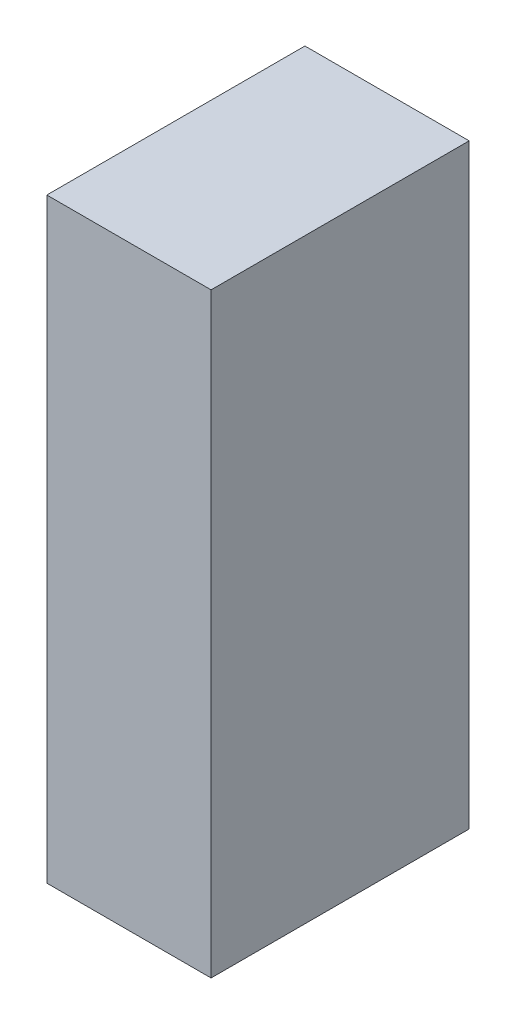
ISO-10303-21;
HEADER;
FILE_DESCRIPTION(('STEP AP214'),'2;1');
FILE_NAME('part.step','',(''),(''),'','','');
FILE_SCHEMA(('AUTOMOTIVE_DESIGN { 1 0 10303 214 1 1 1 1 }'));
ENDSEC;
DATA;
#1=APPLICATION_CONTEXT('core data for automotive mechanical design processes');
#2=APPLICATION_PROTOCOL_DEFINITION('international standard','automotive_design',2000,#1);
#3=PRODUCT_CONTEXT('',#1,'mechanical');
#4=PRODUCT('Part','Part','',(#3));
#5=PRODUCT_RELATED_PRODUCT_CATEGORY('part','',(#4));
#6=PRODUCT_DEFINITION_FORMATION('','',#4);
#7=PRODUCT_DEFINITION_CONTEXT('part definition',#1,'design');
#8=PRODUCT_DEFINITION('design','',#6,#7);
#9=PRODUCT_DEFINITION_SHAPE('','',#8);
#10=(LENGTH_UNIT() NAMED_UNIT(*) SI_UNIT(.MILLI.,.METRE.));
#11=(NAMED_UNIT(*) PLANE_ANGLE_UNIT() SI_UNIT($,.RADIAN.));
#12=(NAMED_UNIT(*) SI_UNIT($,.STERADIAN.) SOLID_ANGLE_UNIT());
#13=UNCERTAINTY_MEASURE_WITH_UNIT(LENGTH_MEASURE(1.E-05),#10,'distance_accuracy_value','');
#14=(GEOMETRIC_REPRESENTATION_CONTEXT(3) GLOBAL_UNCERTAINTY_ASSIGNED_CONTEXT((#13)) GLOBAL_UNIT_ASSIGNED_CONTEXT((#10,
#11,#12)) REPRESENTATION_CONTEXT('',''));
#15=CARTESIAN_POINT('',(0.,0.,0.));
#16=DIRECTION('',(0.,0.,1.));
#17=DIRECTION('',(1.,0.,0.));
#18=AXIS2_PLACEMENT_3D('',#15,#16,#17);
#19=CARTESIAN_POINT('',(17.5,127.,27.5));
#20=DIRECTION('',(-1.,0.,0.));
#21=DIRECTION('',(0.,0.,1.));
#22=AXIS2_PLACEMENT_3D('',#19,#20,#21);
#23=PLANE('',#22);
#24=DIRECTION('',(0.,0.,-1.));
#25=VECTOR('',#24,1.);
#26=CARTESIAN_POINT('',(17.5,0.,27.5));
#27=LINE('',#26,#25);
#28=CARTESIAN_POINT('',(17.5,0.,27.5));
#29=VERTEX_POINT('',#28);
#30=CARTESIAN_POINT('',(17.5,0.,-27.5));
#31=VERTEX_POINT('',#30);
#32=EDGE_CURVE('E107',#29,#31,#27,.T.);
#33=ORIENTED_EDGE('',*,*,#32,.T.);
#34=DIRECTION('',(0.,-1.,0.));
#35=VECTOR('',#34,1.);
#36=CARTESIAN_POINT('',(17.5,127.,-27.5));
#37=LINE('',#36,#35);
#38=CARTESIAN_POINT('',(17.5,127.,-27.5));
#39=VERTEX_POINT('',#38);
#40=EDGE_CURVE('E11',#39,#31,#37,.T.);
#41=ORIENTED_EDGE('',*,*,#40,.F.);
#42=DIRECTION('',(0.,0.,-1.));
#43=VECTOR('',#42,1.);
#44=CARTESIAN_POINT('',(17.5,127.,27.5));
#45=LINE('',#44,#43);
#46=CARTESIAN_POINT('',(17.5,127.,27.5));
#47=VERTEX_POINT('',#46);
#48=EDGE_CURVE('E91',#47,#39,#45,.T.);
#49=ORIENTED_EDGE('',*,*,#48,.F.);
#50=DIRECTION('',(0.,-1.,0.));
#51=VECTOR('',#50,1.);
#52=CARTESIAN_POINT('',(17.5,127.,27.5));
#53=LINE('',#52,#51);
#54=EDGE_CURVE('E103',#47,#29,#53,.T.);
#55=ORIENTED_EDGE('',*,*,#54,.T.);
#56=EDGE_LOOP('',(#33,#41,#49,#55));
#57=FACE_BOUND('',#56,.T.);
#58=ADVANCED_FACE('F39',(#57),#23,.F.);
#59=CARTESIAN_POINT('',(-17.5,127.,-27.5));
#60=DIRECTION('',(0.,0.,1.));
#61=DIRECTION('',(1.,0.,0.));
#62=AXIS2_PLACEMENT_3D('',#59,#60,#61);
#63=PLANE('',#62);
#64=DIRECTION('',(-1.,0.,0.));
#65=VECTOR('',#64,1.);
#66=CARTESIAN_POINT('',(-17.5,0.,-27.5));
#67=LINE('',#66,#65);
#68=CARTESIAN_POINT('',(-17.5,0.,-27.5));
#69=VERTEX_POINT('',#68);
#70=EDGE_CURVE('E96',#31,#69,#67,.T.);
#71=ORIENTED_EDGE('',*,*,#70,.T.);
#72=DIRECTION('',(0.,-1.,0.));
#73=VECTOR('',#72,1.);
#74=CARTESIAN_POINT('',(-17.5,127.,-27.5));
#75=LINE('',#74,#73);
#76=CARTESIAN_POINT('',(-17.5,127.,-27.5));
#77=VERTEX_POINT('',#76);
#78=EDGE_CURVE('E48',#77,#69,#75,.T.);
#79=ORIENTED_EDGE('',*,*,#78,.F.);
#80=DIRECTION('',(-1.,0.,0.));
#81=VECTOR('',#80,1.);
#82=CARTESIAN_POINT('',(-17.5,127.,-27.5));
#83=LINE('',#82,#81);
#84=EDGE_CURVE('E86',#39,#77,#83,.T.);
#85=ORIENTED_EDGE('',*,*,#84,.F.);
#86=ORIENTED_EDGE('',*,*,#40,.T.);
#87=EDGE_LOOP('',(#71,#79,#85,#86));
#88=FACE_BOUND('',#87,.T.);
#89=ADVANCED_FACE('F95',(#88),#63,.F.);
#90=CARTESIAN_POINT('',(-17.5,127.,27.5));
#91=DIRECTION('',(1.,0.,0.));
#92=DIRECTION('',(0.,0.,-1.));
#93=AXIS2_PLACEMENT_3D('',#90,#91,#92);
#94=PLANE('',#93);
#95=DIRECTION('',(0.,0.,1.));
#96=VECTOR('',#95,1.);
#97=CARTESIAN_POINT('',(-17.5,0.,27.5));
#98=LINE('',#97,#96);
#99=CARTESIAN_POINT('',(-17.5,0.,27.5));
#100=VERTEX_POINT('',#99);
#101=EDGE_CURVE('E73',#69,#100,#98,.T.);
#102=ORIENTED_EDGE('',*,*,#101,.T.);
#103=DIRECTION('',(0.,-1.,0.));
#104=VECTOR('',#103,1.);
#105=CARTESIAN_POINT('',(-17.5,127.,27.5));
#106=LINE('',#105,#104);
#107=CARTESIAN_POINT('',(-17.5,127.,27.5));
#108=VERTEX_POINT('',#107);
#109=EDGE_CURVE('E98',#108,#100,#106,.T.);
#110=ORIENTED_EDGE('',*,*,#109,.F.);
#111=DIRECTION('',(0.,0.,1.));
#112=VECTOR('',#111,1.);
#113=CARTESIAN_POINT('',(-17.5,127.,27.5));
#114=LINE('',#113,#112);
#115=EDGE_CURVE('E89',#77,#108,#114,.T.);
#116=ORIENTED_EDGE('',*,*,#115,.F.);
#117=ORIENTED_EDGE('',*,*,#78,.T.);
#118=EDGE_LOOP('',(#102,#110,#116,#117));
#119=FACE_BOUND('',#118,.T.);
#120=ADVANCED_FACE('F99',(#119),#94,.F.);
#121=CARTESIAN_POINT('',(-17.5,127.,27.5));
#122=DIRECTION('',(0.,0.,-1.));
#123=DIRECTION('',(-1.,0.,0.));
#124=AXIS2_PLACEMENT_3D('',#121,#122,#123);
#125=PLANE('',#124);
#126=DIRECTION('',(1.,0.,0.));
#127=VECTOR('',#126,1.);
#128=CARTESIAN_POINT('',(-17.5,0.,27.5));
#129=LINE('',#128,#127);
#130=EDGE_CURVE('E79',#100,#29,#129,.T.);
#131=ORIENTED_EDGE('',*,*,#130,.T.);
#132=ORIENTED_EDGE('',*,*,#54,.F.);
#133=DIRECTION('',(1.,0.,0.));
#134=VECTOR('',#133,1.);
#135=CARTESIAN_POINT('',(-17.5,127.,27.5));
#136=LINE('',#135,#134);
#137=EDGE_CURVE('E56',#108,#47,#136,.T.);
#138=ORIENTED_EDGE('',*,*,#137,.F.);
#139=ORIENTED_EDGE('',*,*,#109,.T.);
#140=EDGE_LOOP('',(#131,#132,#138,#139));
#141=FACE_BOUND('',#140,.T.);
#142=ADVANCED_FACE('F120',(#141),#125,.F.);
#143=CARTESIAN_POINT('',(0.,127.,0.));
#144=DIRECTION('',(0.,-1.,0.));
#145=DIRECTION('',(0.,0.,-1.));
#146=AXIS2_PLACEMENT_3D('',#143,#144,#145);
#147=PLANE('',#146);
#148=ORIENTED_EDGE('',*,*,#48,.T.);
#149=ORIENTED_EDGE('',*,*,#84,.T.);
#150=ORIENTED_EDGE('',*,*,#115,.T.);
#151=ORIENTED_EDGE('',*,*,#137,.T.);
#152=EDGE_LOOP('',(#148,#149,#150,#151));
#153=FACE_BOUND('',#152,.T.);
#154=ADVANCED_FACE('F87',(#153),#147,.F.);
#155=CARTESIAN_POINT('',(0.,0.,0.));
#156=DIRECTION('',(0.,-1.,0.));
#157=DIRECTION('',(0.,0.,-1.));
#158=AXIS2_PLACEMENT_3D('',#155,#156,#157);
#159=PLANE('',#158);
#160=ORIENTED_EDGE('',*,*,#32,.F.);
#161=ORIENTED_EDGE('',*,*,#130,.F.);
#162=ORIENTED_EDGE('',*,*,#101,.F.);
#163=ORIENTED_EDGE('',*,*,#70,.F.);
#164=EDGE_LOOP('',(#160,#161,#162,#163));
#165=FACE_BOUND('',#164,.T.);
#166=ADVANCED_FACE('F123',(#165),#159,.T.);
#167=CLOSED_SHELL('',(#58,#89,#120,#142,#154,#166));
#168=MANIFOLD_SOLID_BREP('B2',#167);
#169=ADVANCED_BREP_SHAPE_REPRESENTATION('',(#18,#168),#14);
#170=SHAPE_DEFINITION_REPRESENTATION(#9,#169);
ENDSEC;
END-ISO-10303-21;
